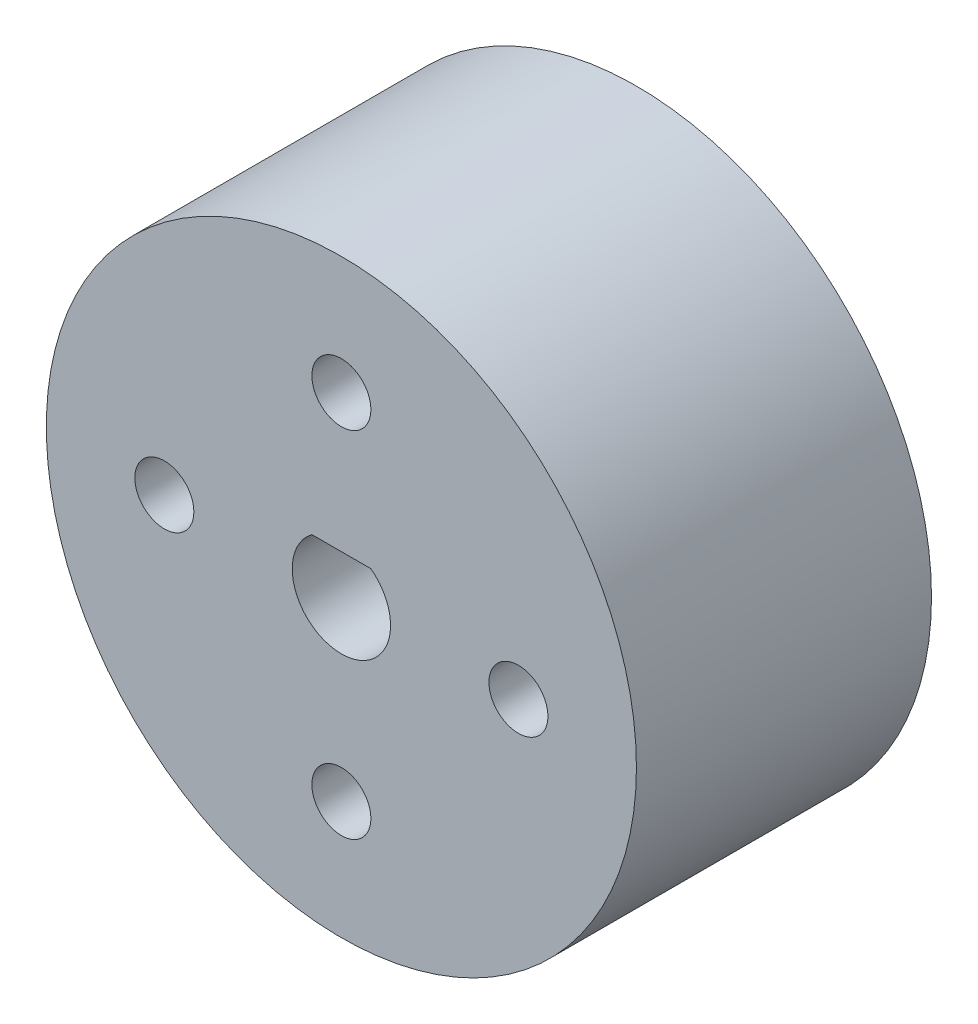
ISO-10303-21;
HEADER;
FILE_DESCRIPTION(('STEP AP214'),'2;1');
FILE_NAME('part.step','',(''),(''),'','','');
FILE_SCHEMA(('AUTOMOTIVE_DESIGN { 1 0 10303 214 1 1 1 1 }'));
ENDSEC;
DATA;
#1=APPLICATION_CONTEXT('core data for automotive mechanical design processes');
#2=APPLICATION_PROTOCOL_DEFINITION('international standard','automotive_design',2000,#1);
#3=PRODUCT_CONTEXT('',#1,'mechanical');
#4=PRODUCT('Part','Part','',(#3));
#5=PRODUCT_RELATED_PRODUCT_CATEGORY('part','',(#4));
#6=PRODUCT_DEFINITION_FORMATION('','',#4);
#7=PRODUCT_DEFINITION_CONTEXT('part definition',#1,'design');
#8=PRODUCT_DEFINITION('design','',#6,#7);
#9=PRODUCT_DEFINITION_SHAPE('','',#8);
#10=(LENGTH_UNIT() NAMED_UNIT(*) SI_UNIT(.MILLI.,.METRE.));
#11=(NAMED_UNIT(*) PLANE_ANGLE_UNIT() SI_UNIT($,.RADIAN.));
#12=(NAMED_UNIT(*) SI_UNIT($,.STERADIAN.) SOLID_ANGLE_UNIT());
#13=UNCERTAINTY_MEASURE_WITH_UNIT(LENGTH_MEASURE(1.E-05),#10,'distance_accuracy_value','');
#14=(GEOMETRIC_REPRESENTATION_CONTEXT(3) GLOBAL_UNCERTAINTY_ASSIGNED_CONTEXT((#13)) GLOBAL_UNIT_ASSIGNED_CONTEXT((#10,
#11,#12)) REPRESENTATION_CONTEXT('',''));
#15=CARTESIAN_POINT('',(0.,0.,0.));
#16=DIRECTION('',(0.,0.,1.));
#17=DIRECTION('',(1.,0.,0.));
#18=AXIS2_PLACEMENT_3D('',#15,#16,#17);
#19=CARTESIAN_POINT('',(0.,0.,15.));
#20=DIRECTION('',(0.,0.,-1.));
#21=DIRECTION('',(-1.,0.,0.));
#22=AXIS2_PLACEMENT_3D('',#19,#20,#21);
#23=CYLINDRICAL_SURFACE('',#22,15.);
#24=CARTESIAN_POINT('',(0.,0.,15.));
#25=DIRECTION('',(0.,0.,1.));
#26=DIRECTION('',(1.,0.,0.));
#27=AXIS2_PLACEMENT_3D('',#24,#25,#26);
#28=CIRCLE('',#27,15.);
#29=CARTESIAN_POINT('',(15.,0.,15.));
#30=VERTEX_POINT('',#29);
#31=EDGE_CURVE('E11',#30,#30,#28,.T.);
#32=ORIENTED_EDGE('',*,*,#31,.F.);
#33=EDGE_LOOP('',(#32));
#34=FACE_BOUND('',#33,.T.);
#35=CARTESIAN_POINT('',(0.,0.,0.));
#36=DIRECTION('',(0.,0.,1.));
#37=DIRECTION('',(1.,0.,0.));
#38=AXIS2_PLACEMENT_3D('',#35,#36,#37);
#39=CIRCLE('',#38,15.);
#40=CARTESIAN_POINT('',(15.,0.,0.));
#41=VERTEX_POINT('',#40);
#42=EDGE_CURVE('E42',#41,#41,#39,.T.);
#43=ORIENTED_EDGE('',*,*,#42,.T.);
#44=EDGE_LOOP('',(#43));
#45=FACE_BOUND('',#44,.T.);
#46=ADVANCED_FACE('F39',(#34,#45),#23,.T.);
#47=CARTESIAN_POINT('',(0.,0.,15.));
#48=DIRECTION('',(0.,0.,1.));
#49=DIRECTION('',(1.,0.,0.));
#50=AXIS2_PLACEMENT_3D('',#47,#48,#49);
#51=PLANE('',#50);
#52=CARTESIAN_POINT('',(0.,9.,15.));
#53=DIRECTION('',(0.,0.,1.));
#54=DIRECTION('',(1.,0.,0.));
#55=AXIS2_PLACEMENT_3D('',#52,#53,#54);
#56=CIRCLE('',#55,1.5);
#57=CARTESIAN_POINT('',(1.5,9.,15.));
#58=VERTEX_POINT('',#57);
#59=EDGE_CURVE('E86',#58,#58,#56,.T.);
#60=ORIENTED_EDGE('',*,*,#59,.F.);
#61=EDGE_LOOP('',(#60));
#62=FACE_BOUND('',#61,.T.);
#63=CARTESIAN_POINT('',(9.00000000000025,2.54142111694787E-13,15.));
#64=DIRECTION('',(0.,0.,1.));
#65=DIRECTION('',(1.,0.,0.));
#66=AXIS2_PLACEMENT_3D('',#63,#64,#65);
#67=CIRCLE('',#66,1.5000000000002);
#68=CARTESIAN_POINT('',(10.5000000000005,2.54142111694787E-13,15.));
#69=VERTEX_POINT('',#68);
#70=EDGE_CURVE('E113',#69,#69,#67,.T.);
#71=ORIENTED_EDGE('',*,*,#70,.F.);
#72=EDGE_LOOP('',(#71));
#73=FACE_BOUND('',#72,.T.);
#74=CARTESIAN_POINT('',(5.08284223389574E-13,-9.,15.));
#75=DIRECTION('',(0.,0.,1.));
#76=DIRECTION('',(1.,0.,0.));
#77=AXIS2_PLACEMENT_3D('',#74,#75,#76);
#78=CIRCLE('',#77,1.50000000000055);
#79=CARTESIAN_POINT('',(1.50000000000105,-9.,15.));
#80=VERTEX_POINT('',#79);
#81=EDGE_CURVE('E105',#80,#80,#78,.T.);
#82=ORIENTED_EDGE('',*,*,#81,.F.);
#83=EDGE_LOOP('',(#82));
#84=FACE_BOUND('',#83,.T.);
#85=CARTESIAN_POINT('',(-8.99999999999975,-2.5524429381402E-13,15.));
#86=DIRECTION('',(0.,0.,1.));
#87=DIRECTION('',(1.,0.,0.));
#88=AXIS2_PLACEMENT_3D('',#85,#86,#87);
#89=CIRCLE('',#88,1.50000000000041);
#90=CARTESIAN_POINT('',(-7.49999999999934,-2.5524429381402E-13,15.));
#91=VERTEX_POINT('',#90);
#92=EDGE_CURVE('E97',#91,#91,#89,.T.);
#93=ORIENTED_EDGE('',*,*,#92,.F.);
#94=EDGE_LOOP('',(#93));
#95=FACE_BOUND('',#94,.T.);
#96=CARTESIAN_POINT('',(0.,0.,15.));
#97=DIRECTION('',(0.,0.,1.));
#98=DIRECTION('',(1.,0.,0.));
#99=AXIS2_PLACEMENT_3D('',#96,#97,#98);
#100=CIRCLE('',#99,2.5);
#101=CARTESIAN_POINT('',(-1.5,2.,15.));
#102=VERTEX_POINT('',#101);
#103=CARTESIAN_POINT('',(1.5,2.,15.));
#104=VERTEX_POINT('',#103);
#105=EDGE_CURVE('E54',#102,#104,#100,.T.);
#106=ORIENTED_EDGE('',*,*,#105,.F.);
#107=DIRECTION('',(-1.,0.,0.));
#108=VECTOR('',#107,1.);
#109=CARTESIAN_POINT('',(-1.5,2.,15.));
#110=LINE('',#109,#108);
#111=EDGE_CURVE('E74',#104,#102,#110,.T.);
#112=ORIENTED_EDGE('',*,*,#111,.F.);
#113=EDGE_LOOP('',(#106,#112));
#114=FACE_BOUND('',#113,.T.);
#115=ORIENTED_EDGE('',*,*,#31,.T.);
#116=EDGE_LOOP('',(#115));
#117=FACE_BOUND('',#116,.T.);
#118=ADVANCED_FACE('F79',(#62,#73,#84,#95,#114,#117),#51,.T.);
#119=CARTESIAN_POINT('',(0.,0.,0.));
#120=DIRECTION('',(0.,0.,1.));
#121=DIRECTION('',(1.,0.,0.));
#122=AXIS2_PLACEMENT_3D('',#119,#120,#121);
#123=PLANE('',#122);
#124=CARTESIAN_POINT('',(0.,9.,0.));
#125=DIRECTION('',(0.,0.,1.));
#126=DIRECTION('',(1.,0.,0.));
#127=AXIS2_PLACEMENT_3D('',#124,#125,#126);
#128=CIRCLE('',#127,1.5);
#129=CARTESIAN_POINT('',(1.5,9.,0.));
#130=VERTEX_POINT('',#129);
#131=EDGE_CURVE('E82',#130,#130,#128,.T.);
#132=ORIENTED_EDGE('',*,*,#131,.T.);
#133=EDGE_LOOP('',(#132));
#134=FACE_BOUND('',#133,.T.);
#135=CARTESIAN_POINT('',(9.00000000000025,2.54142111694787E-13,0.));
#136=DIRECTION('',(0.,0.,1.));
#137=DIRECTION('',(1.,0.,0.));
#138=AXIS2_PLACEMENT_3D('',#135,#136,#137);
#139=CIRCLE('',#138,1.5000000000002);
#140=CARTESIAN_POINT('',(10.5000000000005,2.54142111694787E-13,0.));
#141=VERTEX_POINT('',#140);
#142=EDGE_CURVE('E117',#141,#141,#139,.T.);
#143=ORIENTED_EDGE('',*,*,#142,.T.);
#144=EDGE_LOOP('',(#143));
#145=FACE_BOUND('',#144,.T.);
#146=CARTESIAN_POINT('',(5.08284223389574E-13,-9.,0.));
#147=DIRECTION('',(0.,0.,1.));
#148=DIRECTION('',(1.,0.,0.));
#149=AXIS2_PLACEMENT_3D('',#146,#147,#148);
#150=CIRCLE('',#149,1.50000000000055);
#151=CARTESIAN_POINT('',(1.50000000000105,-9.,0.));
#152=VERTEX_POINT('',#151);
#153=EDGE_CURVE('E109',#152,#152,#150,.T.);
#154=ORIENTED_EDGE('',*,*,#153,.T.);
#155=EDGE_LOOP('',(#154));
#156=FACE_BOUND('',#155,.T.);
#157=CARTESIAN_POINT('',(-8.99999999999975,-2.5524429381402E-13,0.));
#158=DIRECTION('',(0.,0.,1.));
#159=DIRECTION('',(1.,0.,0.));
#160=AXIS2_PLACEMENT_3D('',#157,#158,#159);
#161=CIRCLE('',#160,1.50000000000041);
#162=CARTESIAN_POINT('',(-7.49999999999934,-2.5524429381402E-13,0.));
#163=VERTEX_POINT('',#162);
#164=EDGE_CURVE('E101',#163,#163,#161,.T.);
#165=ORIENTED_EDGE('',*,*,#164,.T.);
#166=EDGE_LOOP('',(#165));
#167=FACE_BOUND('',#166,.T.);
#168=DIRECTION('',(-1.,0.,0.));
#169=VECTOR('',#168,1.);
#170=CARTESIAN_POINT('',(-1.5,2.,0.));
#171=LINE('',#170,#169);
#172=CARTESIAN_POINT('',(1.5,2.,0.));
#173=VERTEX_POINT('',#172);
#174=CARTESIAN_POINT('',(-1.5,2.,0.));
#175=VERTEX_POINT('',#174);
#176=EDGE_CURVE('E89',#173,#175,#171,.T.);
#177=ORIENTED_EDGE('',*,*,#176,.T.);
#178=CARTESIAN_POINT('',(0.,0.,0.));
#179=DIRECTION('',(0.,0.,1.));
#180=DIRECTION('',(1.,0.,0.));
#181=AXIS2_PLACEMENT_3D('',#178,#179,#180);
#182=CIRCLE('',#181,2.5);
#183=EDGE_CURVE('E59',#175,#173,#182,.T.);
#184=ORIENTED_EDGE('',*,*,#183,.T.);
#185=EDGE_LOOP('',(#177,#184));
#186=FACE_BOUND('',#185,.T.);
#187=ORIENTED_EDGE('',*,*,#42,.F.);
#188=EDGE_LOOP('',(#187));
#189=FACE_BOUND('',#188,.T.);
#190=ADVANCED_FACE('F129',(#134,#145,#156,#167,#186,#189),#123,.F.);
#191=CARTESIAN_POINT('',(0.,0.,0.));
#192=DIRECTION('',(0.,0.,1.));
#193=DIRECTION('',(1.,0.,0.));
#194=AXIS2_PLACEMENT_3D('',#191,#192,#193);
#195=CYLINDRICAL_SURFACE('',#194,2.5);
#196=ORIENTED_EDGE('',*,*,#105,.T.);
#197=DIRECTION('',(0.,0.,1.));
#198=VECTOR('',#197,1.);
#199=CARTESIAN_POINT('',(1.5,2.,0.));
#200=LINE('',#199,#198);
#201=EDGE_CURVE('E71',#173,#104,#200,.T.);
#202=ORIENTED_EDGE('',*,*,#201,.F.);
#203=ORIENTED_EDGE('',*,*,#183,.F.);
#204=DIRECTION('',(0.,0.,1.));
#205=VECTOR('',#204,1.);
#206=CARTESIAN_POINT('',(-1.5,2.,0.));
#207=LINE('',#206,#205);
#208=EDGE_CURVE('E64',#175,#102,#207,.T.);
#209=ORIENTED_EDGE('',*,*,#208,.T.);
#210=EDGE_LOOP('',(#196,#202,#203,#209));
#211=FACE_BOUND('',#210,.T.);
#212=ADVANCED_FACE('F66',(#211),#195,.F.);
#213=CARTESIAN_POINT('',(-1.5,2.,0.));
#214=DIRECTION('',(0.,1.,0.));
#215=DIRECTION('',(0.,0.,1.));
#216=AXIS2_PLACEMENT_3D('',#213,#214,#215);
#217=PLANE('',#216);
#218=ORIENTED_EDGE('',*,*,#111,.T.);
#219=ORIENTED_EDGE('',*,*,#208,.F.);
#220=ORIENTED_EDGE('',*,*,#176,.F.);
#221=ORIENTED_EDGE('',*,*,#201,.T.);
#222=EDGE_LOOP('',(#218,#219,#220,#221));
#223=FACE_BOUND('',#222,.T.);
#224=ADVANCED_FACE('F75',(#223),#217,.F.);
#225=CARTESIAN_POINT('',(-8.99999999999975,-2.5524429381402E-13,0.));
#226=DIRECTION('',(0.,0.,1.));
#227=DIRECTION('',(1.,0.,0.));
#228=AXIS2_PLACEMENT_3D('',#225,#226,#227);
#229=CYLINDRICAL_SURFACE('',#228,1.50000000000041);
#230=ORIENTED_EDGE('',*,*,#164,.F.);
#231=EDGE_LOOP('',(#230));
#232=FACE_BOUND('',#231,.T.);
#233=ORIENTED_EDGE('',*,*,#92,.T.);
#234=EDGE_LOOP('',(#233));
#235=FACE_BOUND('',#234,.T.);
#236=ADVANCED_FACE('F137',(#232,#235),#229,.F.);
#237=CARTESIAN_POINT('',(5.08284223389574E-13,-9.,0.));
#238=DIRECTION('',(0.,0.,1.));
#239=DIRECTION('',(1.,0.,0.));
#240=AXIS2_PLACEMENT_3D('',#237,#238,#239);
#241=CYLINDRICAL_SURFACE('',#240,1.50000000000055);
#242=ORIENTED_EDGE('',*,*,#153,.F.);
#243=EDGE_LOOP('',(#242));
#244=FACE_BOUND('',#243,.T.);
#245=ORIENTED_EDGE('',*,*,#81,.T.);
#246=EDGE_LOOP('',(#245));
#247=FACE_BOUND('',#246,.T.);
#248=ADVANCED_FACE('F139',(#244,#247),#241,.F.);
#249=CARTESIAN_POINT('',(9.00000000000025,2.54142111694787E-13,0.));
#250=DIRECTION('',(0.,0.,1.));
#251=DIRECTION('',(1.,0.,0.));
#252=AXIS2_PLACEMENT_3D('',#249,#250,#251);
#253=CYLINDRICAL_SURFACE('',#252,1.5000000000002);
#254=ORIENTED_EDGE('',*,*,#142,.F.);
#255=EDGE_LOOP('',(#254));
#256=FACE_BOUND('',#255,.T.);
#257=ORIENTED_EDGE('',*,*,#70,.T.);
#258=EDGE_LOOP('',(#257));
#259=FACE_BOUND('',#258,.T.);
#260=ADVANCED_FACE('F146',(#256,#259),#253,.F.);
#261=CARTESIAN_POINT('',(0.,9.,0.));
#262=DIRECTION('',(0.,0.,1.));
#263=DIRECTION('',(1.,0.,0.));
#264=AXIS2_PLACEMENT_3D('',#261,#262,#263);
#265=CYLINDRICAL_SURFACE('',#264,1.5);
#266=ORIENTED_EDGE('',*,*,#131,.F.);
#267=EDGE_LOOP('',(#266));
#268=FACE_BOUND('',#267,.T.);
#269=ORIENTED_EDGE('',*,*,#59,.T.);
#270=EDGE_LOOP('',(#269));
#271=FACE_BOUND('',#270,.T.);
#272=ADVANCED_FACE('F125',(#268,#271),#265,.F.);
#273=CLOSED_SHELL('',(#46,#118,#190,#212,#224,#236,#248,#260,#272));
#274=MANIFOLD_SOLID_BREP('B2',#273);
#275=ADVANCED_BREP_SHAPE_REPRESENTATION('',(#18,#274),#14);
#276=SHAPE_DEFINITION_REPRESENTATION(#9,#275);
ENDSEC;
END-ISO-10303-21;
